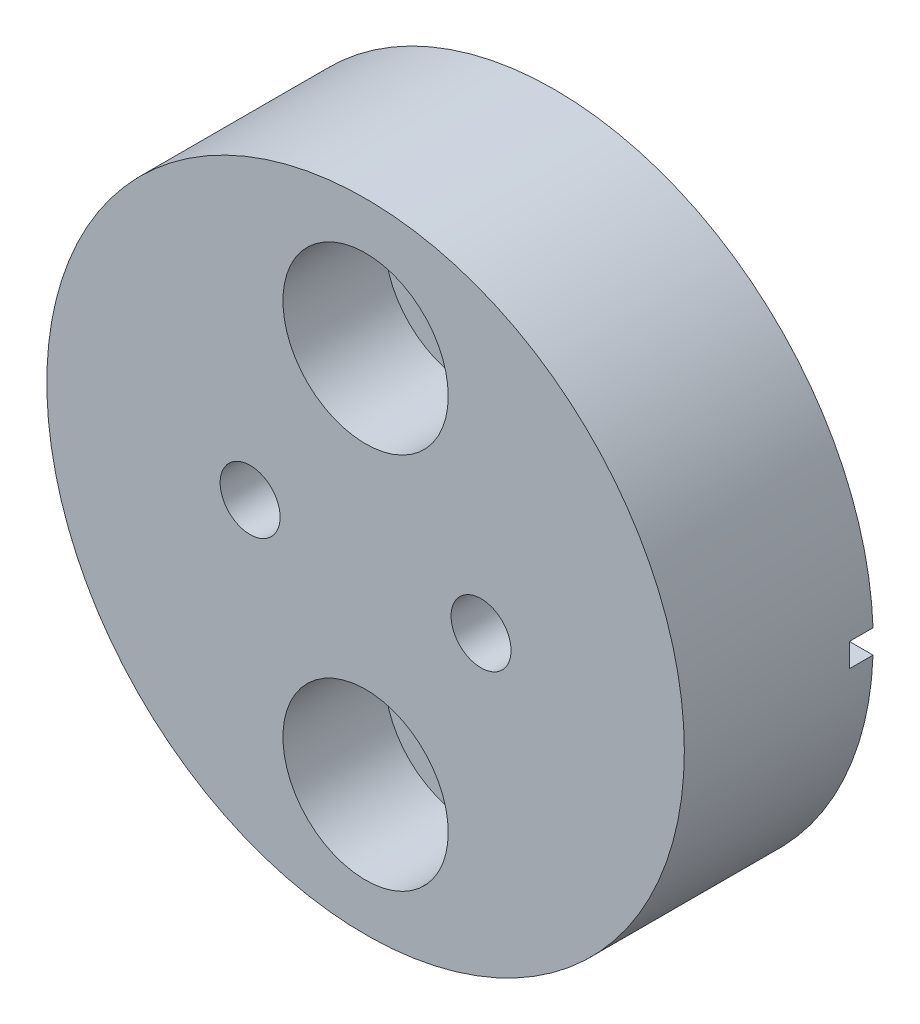
ISO-10303-21;
HEADER;
FILE_DESCRIPTION(('STEP AP214'),'2;1');
FILE_NAME('part.step','',(''),(''),'','','');
FILE_SCHEMA(('AUTOMOTIVE_DESIGN { 1 0 10303 214 1 1 1 1 }'));
ENDSEC;
DATA;
#1=APPLICATION_CONTEXT('core data for automotive mechanical design processes');
#2=APPLICATION_PROTOCOL_DEFINITION('international standard','automotive_design',2000,#1);
#3=PRODUCT_CONTEXT('',#1,'mechanical');
#4=PRODUCT('Part','Part','',(#3));
#5=PRODUCT_RELATED_PRODUCT_CATEGORY('part','',(#4));
#6=PRODUCT_DEFINITION_FORMATION('','',#4);
#7=PRODUCT_DEFINITION_CONTEXT('part definition',#1,'design');
#8=PRODUCT_DEFINITION('design','',#6,#7);
#9=PRODUCT_DEFINITION_SHAPE('','',#8);
#10=(LENGTH_UNIT() NAMED_UNIT(*) SI_UNIT(.MILLI.,.METRE.));
#11=(NAMED_UNIT(*) PLANE_ANGLE_UNIT() SI_UNIT($,.RADIAN.));
#12=(NAMED_UNIT(*) SI_UNIT($,.STERADIAN.) SOLID_ANGLE_UNIT());
#13=UNCERTAINTY_MEASURE_WITH_UNIT(LENGTH_MEASURE(1.E-05),#10,'distance_accuracy_value','');
#14=(GEOMETRIC_REPRESENTATION_CONTEXT(3) GLOBAL_UNCERTAINTY_ASSIGNED_CONTEXT((#13)) GLOBAL_UNIT_ASSIGNED_CONTEXT((#10,
#11,#12)) REPRESENTATION_CONTEXT('',''));
#15=CARTESIAN_POINT('',(0.,0.,0.));
#16=DIRECTION('',(0.,0.,1.));
#17=DIRECTION('',(1.,0.,0.));
#18=AXIS2_PLACEMENT_3D('',#15,#16,#17);
#19=CARTESIAN_POINT('',(0.,-8.,-2.));
#20=DIRECTION('',(0.,0.,1.));
#21=DIRECTION('',(1.,0.,0.));
#22=AXIS2_PLACEMENT_3D('',#19,#20,#21);
#23=CYLINDRICAL_SURFACE('',#22,2.3);
#24=CARTESIAN_POINT('',(0.,-8.,0.));
#25=DIRECTION('',(0.,0.,1.));
#26=DIRECTION('',(1.,0.,0.));
#27=AXIS2_PLACEMENT_3D('',#24,#25,#26);
#28=CIRCLE('',#27,2.3);
#29=CARTESIAN_POINT('',(2.3,-8.,0.));
#30=VERTEX_POINT('',#29);
#31=EDGE_CURVE('E158',#30,#30,#28,.F.);
#32=ORIENTED_EDGE('',*,*,#31,.T.);
#33=EDGE_LOOP('',(#32));
#34=FACE_BOUND('',#33,.T.);
#35=CARTESIAN_POINT('',(0.,-8.,3.68));
#36=DIRECTION('',(0.,0.,1.));
#37=DIRECTION('',(1.,0.,0.));
#38=AXIS2_PLACEMENT_3D('',#35,#36,#37);
#39=CIRCLE('',#38,2.3);
#40=CARTESIAN_POINT('',(2.3,-8.,3.68));
#41=VERTEX_POINT('',#40);
#42=EDGE_CURVE('E39',#41,#41,#39,.T.);
#43=ORIENTED_EDGE('',*,*,#42,.T.);
#44=EDGE_LOOP('',(#43));
#45=FACE_BOUND('',#44,.T.);
#46=ADVANCED_FACE('F35',(#34,#45),#23,.F.);
#47=CARTESIAN_POINT('',(0.,8.,-2.));
#48=DIRECTION('',(0.,0.,1.));
#49=DIRECTION('',(1.,0.,0.));
#50=AXIS2_PLACEMENT_3D('',#47,#48,#49);
#51=CYLINDRICAL_SURFACE('',#50,2.3);
#52=CARTESIAN_POINT('',(0.,8.,0.));
#53=DIRECTION('',(0.,0.,1.));
#54=DIRECTION('',(1.,0.,0.));
#55=AXIS2_PLACEMENT_3D('',#52,#53,#54);
#56=CIRCLE('',#55,2.3);
#57=CARTESIAN_POINT('',(2.3,8.,0.));
#58=VERTEX_POINT('',#57);
#59=EDGE_CURVE('E167',#58,#58,#56,.T.);
#60=ORIENTED_EDGE('',*,*,#59,.F.);
#61=EDGE_LOOP('',(#60));
#62=FACE_BOUND('',#61,.T.);
#63=CARTESIAN_POINT('',(0.,8.,3.68));
#64=DIRECTION('',(0.,0.,1.));
#65=DIRECTION('',(1.,0.,0.));
#66=AXIS2_PLACEMENT_3D('',#63,#64,#65);
#67=CIRCLE('',#66,2.3);
#68=CARTESIAN_POINT('',(2.3,8.,3.68));
#69=VERTEX_POINT('',#68);
#70=EDGE_CURVE('E131',#69,#69,#67,.F.);
#71=ORIENTED_EDGE('',*,*,#70,.F.);
#72=EDGE_LOOP('',(#71));
#73=FACE_BOUND('',#72,.T.);
#74=ADVANCED_FACE('F223',(#62,#73),#51,.F.);
#75=CARTESIAN_POINT('',(0.,0.,8.));
#76=DIRECTION('',(0.,0.,-1.));
#77=DIRECTION('',(-1.,0.,0.));
#78=AXIS2_PLACEMENT_3D('',#75,#76,#77);
#79=CYLINDRICAL_SURFACE('',#78,13.5);
#80=CARTESIAN_POINT('',(0.,0.,8.));
#81=DIRECTION('',(0.,0.,1.));
#82=DIRECTION('',(1.,0.,0.));
#83=AXIS2_PLACEMENT_3D('',#80,#81,#82);
#84=CIRCLE('',#83,13.5);
#85=CARTESIAN_POINT('',(13.5,0.,8.));
#86=VERTEX_POINT('',#85);
#87=EDGE_CURVE('E159',#86,#86,#84,.T.);
#88=ORIENTED_EDGE('',*,*,#87,.F.);
#89=EDGE_LOOP('',(#88));
#90=FACE_BOUND('',#89,.T.);
#91=DIRECTION('',(0.,0.,-1.));
#92=VECTOR('',#91,1.);
#93=CARTESIAN_POINT('',(-13.490737563232,0.5,8.));
#94=LINE('',#93,#92);
#95=CARTESIAN_POINT('',(-13.490737563232,0.5,1.));
#96=VERTEX_POINT('',#95);
#97=CARTESIAN_POINT('',(-13.490737563232,0.5,0.));
#98=VERTEX_POINT('',#97);
#99=EDGE_CURVE('E135',#96,#98,#94,.T.);
#100=ORIENTED_EDGE('',*,*,#99,.F.);
#101=CARTESIAN_POINT('',(0.,0.,1.));
#102=DIRECTION('',(0.,0.,-1.));
#103=DIRECTION('',(-1.,0.,0.));
#104=AXIS2_PLACEMENT_3D('',#101,#102,#103);
#105=CIRCLE('',#104,13.5);
#106=CARTESIAN_POINT('',(-13.490737563232,-0.5,1.));
#107=VERTEX_POINT('',#106);
#108=EDGE_CURVE('E11',#107,#96,#105,.T.);
#109=ORIENTED_EDGE('',*,*,#108,.F.);
#110=DIRECTION('',(0.,0.,-1.));
#111=VECTOR('',#110,1.);
#112=CARTESIAN_POINT('',(-13.490737563232,-0.5,8.));
#113=LINE('',#112,#111);
#114=CARTESIAN_POINT('',(-13.490737563232,-0.5,0.));
#115=VERTEX_POINT('',#114);
#116=EDGE_CURVE('E108',#115,#107,#113,.F.);
#117=ORIENTED_EDGE('',*,*,#116,.F.);
#118=CARTESIAN_POINT('',(0.,0.,0.));
#119=DIRECTION('',(0.,0.,1.));
#120=DIRECTION('',(1.,0.,0.));
#121=AXIS2_PLACEMENT_3D('',#118,#119,#120);
#122=CIRCLE('',#121,13.5);
#123=CARTESIAN_POINT('',(13.490737563232,-0.5,0.));
#124=VERTEX_POINT('',#123);
#125=EDGE_CURVE('E166',#115,#124,#122,.T.);
#126=ORIENTED_EDGE('',*,*,#125,.T.);
#127=DIRECTION('',(0.,0.,-1.));
#128=VECTOR('',#127,1.);
#129=CARTESIAN_POINT('',(13.490737563232,-0.5,8.));
#130=LINE('',#129,#128);
#131=CARTESIAN_POINT('',(13.490737563232,-0.5,1.));
#132=VERTEX_POINT('',#131);
#133=EDGE_CURVE('E155',#124,#132,#130,.F.);
#134=ORIENTED_EDGE('',*,*,#133,.T.);
#135=CARTESIAN_POINT('',(0.,0.,1.));
#136=DIRECTION('',(0.,0.,-1.));
#137=DIRECTION('',(-1.,0.,0.));
#138=AXIS2_PLACEMENT_3D('',#135,#136,#137);
#139=CIRCLE('',#138,13.5);
#140=CARTESIAN_POINT('',(13.490737563232,0.5,1.));
#141=VERTEX_POINT('',#140);
#142=EDGE_CURVE('E174',#141,#132,#139,.T.);
#143=ORIENTED_EDGE('',*,*,#142,.F.);
#144=DIRECTION('',(0.,0.,-1.));
#145=VECTOR('',#144,1.);
#146=CARTESIAN_POINT('',(13.490737563232,0.5,8.));
#147=LINE('',#146,#145);
#148=CARTESIAN_POINT('',(13.490737563232,0.5,0.));
#149=VERTEX_POINT('',#148);
#150=EDGE_CURVE('E151',#141,#149,#147,.T.);
#151=ORIENTED_EDGE('',*,*,#150,.T.);
#152=EDGE_CURVE('E163',#149,#98,#122,.T.);
#153=ORIENTED_EDGE('',*,*,#152,.T.);
#154=EDGE_LOOP('',(#100,#109,#117,#126,#134,#143,#151,#153));
#155=FACE_BOUND('',#154,.T.);
#156=ADVANCED_FACE('F37',(#90,#155),#79,.T.);
#157=CARTESIAN_POINT('',(0.,0.,0.));
#158=DIRECTION('',(0.,0.,1.));
#159=DIRECTION('',(1.,0.,0.));
#160=AXIS2_PLACEMENT_3D('',#157,#158,#159);
#161=PLANE('',#160);
#162=CARTESIAN_POINT('',(-4.89,0.,0.));
#163=DIRECTION('',(0.,0.,1.));
#164=DIRECTION('',(1.,0.,0.));
#165=AXIS2_PLACEMENT_3D('',#162,#163,#164);
#166=CIRCLE('',#165,1.27);
#167=CARTESIAN_POINT('',(-3.62,0.,0.));
#168=VERTEX_POINT('',#167);
#169=EDGE_CURVE('E197',#168,#168,#166,.T.);
#170=ORIENTED_EDGE('',*,*,#169,.T.);
#171=EDGE_LOOP('',(#170));
#172=FACE_BOUND('',#171,.T.);
#173=CARTESIAN_POINT('',(4.89,0.,0.));
#174=DIRECTION('',(0.,0.,1.));
#175=DIRECTION('',(1.,0.,0.));
#176=AXIS2_PLACEMENT_3D('',#173,#174,#175);
#177=CIRCLE('',#176,1.27);
#178=CARTESIAN_POINT('',(6.16,0.,0.));
#179=VERTEX_POINT('',#178);
#180=EDGE_CURVE('E189',#179,#179,#177,.T.);
#181=ORIENTED_EDGE('',*,*,#180,.T.);
#182=EDGE_LOOP('',(#181));
#183=FACE_BOUND('',#182,.T.);
#184=ORIENTED_EDGE('',*,*,#59,.T.);
#185=EDGE_LOOP('',(#184));
#186=FACE_BOUND('',#185,.T.);
#187=ORIENTED_EDGE('',*,*,#31,.F.);
#188=EDGE_LOOP('',(#187));
#189=FACE_BOUND('',#188,.T.);
#190=DIRECTION('',(-1.,0.,0.));
#191=VECTOR('',#190,1.);
#192=CARTESIAN_POINT('',(-18.5,0.5,0.));
#193=LINE('',#192,#191);
#194=CARTESIAN_POINT('',(-8.5,0.5,0.));
#195=VERTEX_POINT('',#194);
#196=EDGE_CURVE('E122',#195,#98,#193,.T.);
#197=ORIENTED_EDGE('',*,*,#196,.T.);
#198=ORIENTED_EDGE('',*,*,#152,.F.);
#199=DIRECTION('',(1.,0.,0.));
#200=VECTOR('',#199,1.);
#201=CARTESIAN_POINT('',(18.5,0.5,0.));
#202=LINE('',#201,#200);
#203=CARTESIAN_POINT('',(8.5,0.5,0.));
#204=VERTEX_POINT('',#203);
#205=EDGE_CURVE('E141',#204,#149,#202,.T.);
#206=ORIENTED_EDGE('',*,*,#205,.F.);
#207=DIRECTION('',(0.,1.,0.));
#208=VECTOR('',#207,1.);
#209=CARTESIAN_POINT('',(8.5,0.5,0.));
#210=LINE('',#209,#208);
#211=CARTESIAN_POINT('',(8.5,-0.5,0.));
#212=VERTEX_POINT('',#211);
#213=EDGE_CURVE('E60',#212,#204,#210,.T.);
#214=ORIENTED_EDGE('',*,*,#213,.F.);
#215=DIRECTION('',(1.,0.,0.));
#216=VECTOR('',#215,1.);
#217=CARTESIAN_POINT('',(0.,-0.5,0.));
#218=LINE('',#217,#216);
#219=EDGE_CURVE('E162',#212,#124,#218,.T.);
#220=ORIENTED_EDGE('',*,*,#219,.T.);
#221=ORIENTED_EDGE('',*,*,#125,.F.);
#222=DIRECTION('',(-1.,0.,0.));
#223=VECTOR('',#222,1.);
#224=CARTESIAN_POINT('',(0.,-0.5,0.));
#225=LINE('',#224,#223);
#226=CARTESIAN_POINT('',(-8.5,-0.5,0.));
#227=VERTEX_POINT('',#226);
#228=EDGE_CURVE('E44',#227,#115,#225,.T.);
#229=ORIENTED_EDGE('',*,*,#228,.F.);
#230=DIRECTION('',(0.,1.,0.));
#231=VECTOR('',#230,1.);
#232=CARTESIAN_POINT('',(-8.5,0.5,0.));
#233=LINE('',#232,#231);
#234=EDGE_CURVE('E52',#227,#195,#233,.T.);
#235=ORIENTED_EDGE('',*,*,#234,.T.);
#236=EDGE_LOOP('',(#197,#198,#206,#214,#220,#221,#229,#235));
#237=FACE_BOUND('',#236,.T.);
#238=ADVANCED_FACE('F211',(#172,#183,#186,#189,#237),#161,.F.);
#239=CARTESIAN_POINT('',(0.,0.,8.));
#240=DIRECTION('',(0.,0.,1.));
#241=DIRECTION('',(1.,0.,0.));
#242=AXIS2_PLACEMENT_3D('',#239,#240,#241);
#243=PLANE('',#242);
#244=CARTESIAN_POINT('',(-4.89,0.,8.));
#245=DIRECTION('',(0.,0.,1.));
#246=DIRECTION('',(1.,0.,0.));
#247=AXIS2_PLACEMENT_3D('',#244,#245,#246);
#248=CIRCLE('',#247,1.27);
#249=CARTESIAN_POINT('',(-3.62,0.,8.));
#250=VERTEX_POINT('',#249);
#251=EDGE_CURVE('E200',#250,#250,#248,.T.);
#252=ORIENTED_EDGE('',*,*,#251,.F.);
#253=EDGE_LOOP('',(#252));
#254=FACE_BOUND('',#253,.T.);
#255=CARTESIAN_POINT('',(4.89,0.,8.));
#256=DIRECTION('',(0.,0.,1.));
#257=DIRECTION('',(1.,0.,0.));
#258=AXIS2_PLACEMENT_3D('',#255,#256,#257);
#259=CIRCLE('',#258,1.27);
#260=CARTESIAN_POINT('',(6.16,0.,8.));
#261=VERTEX_POINT('',#260);
#262=EDGE_CURVE('E194',#261,#261,#259,.T.);
#263=ORIENTED_EDGE('',*,*,#262,.F.);
#264=EDGE_LOOP('',(#263));
#265=FACE_BOUND('',#264,.T.);
#266=CARTESIAN_POINT('',(0.,-8.,8.));
#267=DIRECTION('',(0.,0.,-1.));
#268=DIRECTION('',(1.,0.,0.));
#269=AXIS2_PLACEMENT_3D('',#266,#267,#268);
#270=CIRCLE('',#269,3.5);
#271=CARTESIAN_POINT('',(3.5,-8.,8.));
#272=VERTEX_POINT('',#271);
#273=EDGE_CURVE('E185',#272,#272,#270,.T.);
#274=ORIENTED_EDGE('',*,*,#273,.T.);
#275=EDGE_LOOP('',(#274));
#276=FACE_BOUND('',#275,.T.);
#277=CARTESIAN_POINT('',(0.,8.,8.));
#278=DIRECTION('',(0.,0.,1.));
#279=DIRECTION('',(1.,0.,0.));
#280=AXIS2_PLACEMENT_3D('',#277,#278,#279);
#281=CIRCLE('',#280,3.5);
#282=CARTESIAN_POINT('',(3.5,8.,8.));
#283=VERTEX_POINT('',#282);
#284=EDGE_CURVE('E127',#283,#283,#281,.T.);
#285=ORIENTED_EDGE('',*,*,#284,.F.);
#286=EDGE_LOOP('',(#285));
#287=FACE_BOUND('',#286,.T.);
#288=ORIENTED_EDGE('',*,*,#87,.T.);
#289=EDGE_LOOP('',(#288));
#290=FACE_BOUND('',#289,.T.);
#291=ADVANCED_FACE('F207',(#254,#265,#276,#287,#290),#243,.T.);
#292=CARTESIAN_POINT('',(0.,0.,1.));
#293=DIRECTION('',(0.,0.,-1.));
#294=DIRECTION('',(-1.,0.,0.));
#295=AXIS2_PLACEMENT_3D('',#292,#293,#294);
#296=PLANE('',#295);
#297=ORIENTED_EDGE('',*,*,#142,.T.);
#298=DIRECTION('',(-1.,0.,0.));
#299=VECTOR('',#298,1.);
#300=CARTESIAN_POINT('',(18.5,-0.5,1.));
#301=LINE('',#300,#299);
#302=CARTESIAN_POINT('',(8.5,-0.5,1.));
#303=VERTEX_POINT('',#302);
#304=EDGE_CURVE('E144',#132,#303,#301,.T.);
#305=ORIENTED_EDGE('',*,*,#304,.T.);
#306=DIRECTION('',(0.,1.,0.));
#307=VECTOR('',#306,1.);
#308=CARTESIAN_POINT('',(8.5,0.5,1.));
#309=LINE('',#308,#307);
#310=CARTESIAN_POINT('',(8.5,0.5,1.));
#311=VERTEX_POINT('',#310);
#312=EDGE_CURVE('E137',#303,#311,#309,.T.);
#313=ORIENTED_EDGE('',*,*,#312,.T.);
#314=DIRECTION('',(1.,0.,0.));
#315=VECTOR('',#314,1.);
#316=CARTESIAN_POINT('',(18.5,0.5,1.));
#317=LINE('',#316,#315);
#318=EDGE_CURVE('E140',#311,#141,#317,.T.);
#319=ORIENTED_EDGE('',*,*,#318,.T.);
#320=EDGE_LOOP('',(#297,#305,#313,#319));
#321=FACE_BOUND('',#320,.T.);
#322=ADVANCED_FACE('F210',(#321),#296,.T.);
#323=CARTESIAN_POINT('',(18.5,-0.5,1.));
#324=DIRECTION('',(0.,-1.,0.));
#325=DIRECTION('',(0.,0.,-1.));
#326=AXIS2_PLACEMENT_3D('',#323,#324,#325);
#327=PLANE('',#326);
#328=ORIENTED_EDGE('',*,*,#219,.F.);
#329=DIRECTION('',(0.,0.,-1.));
#330=VECTOR('',#329,1.);
#331=CARTESIAN_POINT('',(8.5,-0.5,1.));
#332=LINE('',#331,#330);
#333=EDGE_CURVE('E149',#303,#212,#332,.T.);
#334=ORIENTED_EDGE('',*,*,#333,.F.);
#335=ORIENTED_EDGE('',*,*,#304,.F.);
#336=ORIENTED_EDGE('',*,*,#133,.F.);
#337=EDGE_LOOP('',(#328,#334,#335,#336));
#338=FACE_BOUND('',#337,.T.);
#339=ADVANCED_FACE('F235',(#338),#327,.F.);
#340=CARTESIAN_POINT('',(18.5,0.5,1.));
#341=DIRECTION('',(0.,1.,0.));
#342=DIRECTION('',(0.,0.,1.));
#343=AXIS2_PLACEMENT_3D('',#340,#341,#342);
#344=PLANE('',#343);
#345=ORIENTED_EDGE('',*,*,#318,.F.);
#346=DIRECTION('',(0.,0.,-1.));
#347=VECTOR('',#346,1.);
#348=CARTESIAN_POINT('',(8.5,0.5,1.));
#349=LINE('',#348,#347);
#350=EDGE_CURVE('E146',#311,#204,#349,.T.);
#351=ORIENTED_EDGE('',*,*,#350,.T.);
#352=ORIENTED_EDGE('',*,*,#205,.T.);
#353=ORIENTED_EDGE('',*,*,#150,.F.);
#354=EDGE_LOOP('',(#345,#351,#352,#353));
#355=FACE_BOUND('',#354,.T.);
#356=ADVANCED_FACE('F239',(#355),#344,.F.);
#357=CARTESIAN_POINT('',(8.5,0.5,1.));
#358=DIRECTION('',(-1.,0.,0.));
#359=DIRECTION('',(0.,0.,1.));
#360=AXIS2_PLACEMENT_3D('',#357,#358,#359);
#361=PLANE('',#360);
#362=ORIENTED_EDGE('',*,*,#213,.T.);
#363=ORIENTED_EDGE('',*,*,#350,.F.);
#364=ORIENTED_EDGE('',*,*,#312,.F.);
#365=ORIENTED_EDGE('',*,*,#333,.T.);
#366=EDGE_LOOP('',(#362,#363,#364,#365));
#367=FACE_BOUND('',#366,.T.);
#368=ADVANCED_FACE('F242',(#367),#361,.F.);
#369=CARTESIAN_POINT('',(0.,0.,1.));
#370=DIRECTION('',(0.,0.,-1.));
#371=DIRECTION('',(1.,0.,0.));
#372=AXIS2_PLACEMENT_3D('',#369,#370,#371);
#373=PLANE('',#372);
#374=ORIENTED_EDGE('',*,*,#108,.T.);
#375=DIRECTION('',(-1.,0.,0.));
#376=VECTOR('',#375,1.);
#377=CARTESIAN_POINT('',(-18.5,0.5,1.));
#378=LINE('',#377,#376);
#379=CARTESIAN_POINT('',(-8.5,0.5,1.));
#380=VERTEX_POINT('',#379);
#381=EDGE_CURVE('E112',#380,#96,#378,.T.);
#382=ORIENTED_EDGE('',*,*,#381,.F.);
#383=DIRECTION('',(0.,1.,0.));
#384=VECTOR('',#383,1.);
#385=CARTESIAN_POINT('',(-8.5,0.5,1.));
#386=LINE('',#385,#384);
#387=CARTESIAN_POINT('',(-8.5,-0.5,1.));
#388=VERTEX_POINT('',#387);
#389=EDGE_CURVE('E113',#388,#380,#386,.T.);
#390=ORIENTED_EDGE('',*,*,#389,.F.);
#391=DIRECTION('',(1.,0.,0.));
#392=VECTOR('',#391,1.);
#393=CARTESIAN_POINT('',(-18.5,-0.5,1.));
#394=LINE('',#393,#392);
#395=EDGE_CURVE('E103',#107,#388,#394,.T.);
#396=ORIENTED_EDGE('',*,*,#395,.F.);
#397=EDGE_LOOP('',(#374,#382,#390,#396));
#398=FACE_BOUND('',#397,.T.);
#399=ADVANCED_FACE('F120',(#398),#373,.T.);
#400=CARTESIAN_POINT('',(-18.5,0.5,1.));
#401=DIRECTION('',(0.,-1.,0.));
#402=DIRECTION('',(0.,0.,-1.));
#403=AXIS2_PLACEMENT_3D('',#400,#401,#402);
#404=PLANE('',#403);
#405=ORIENTED_EDGE('',*,*,#99,.T.);
#406=ORIENTED_EDGE('',*,*,#196,.F.);
#407=DIRECTION('',(0.,0.,-1.));
#408=VECTOR('',#407,1.);
#409=CARTESIAN_POINT('',(-8.5,0.5,1.));
#410=LINE('',#409,#408);
#411=EDGE_CURVE('E118',#380,#195,#410,.T.);
#412=ORIENTED_EDGE('',*,*,#411,.F.);
#413=ORIENTED_EDGE('',*,*,#381,.T.);
#414=EDGE_LOOP('',(#405,#406,#412,#413));
#415=FACE_BOUND('',#414,.T.);
#416=ADVANCED_FACE('F227',(#415),#404,.T.);
#417=CARTESIAN_POINT('',(-18.5,-0.5,1.));
#418=DIRECTION('',(0.,1.,0.));
#419=DIRECTION('',(0.,0.,1.));
#420=AXIS2_PLACEMENT_3D('',#417,#418,#419);
#421=PLANE('',#420);
#422=ORIENTED_EDGE('',*,*,#116,.T.);
#423=ORIENTED_EDGE('',*,*,#395,.T.);
#424=DIRECTION('',(0.,0.,-1.));
#425=VECTOR('',#424,1.);
#426=CARTESIAN_POINT('',(-8.5,-0.5,1.));
#427=LINE('',#426,#425);
#428=EDGE_CURVE('E105',#388,#227,#427,.T.);
#429=ORIENTED_EDGE('',*,*,#428,.T.);
#430=ORIENTED_EDGE('',*,*,#228,.T.);
#431=EDGE_LOOP('',(#422,#423,#429,#430));
#432=FACE_BOUND('',#431,.T.);
#433=ADVANCED_FACE('F104',(#432),#421,.T.);
#434=CARTESIAN_POINT('',(-8.5,0.5,1.));
#435=DIRECTION('',(-1.,0.,0.));
#436=DIRECTION('',(0.,0.,1.));
#437=AXIS2_PLACEMENT_3D('',#434,#435,#436);
#438=PLANE('',#437);
#439=ORIENTED_EDGE('',*,*,#234,.F.);
#440=ORIENTED_EDGE('',*,*,#428,.F.);
#441=ORIENTED_EDGE('',*,*,#389,.T.);
#442=ORIENTED_EDGE('',*,*,#411,.T.);
#443=EDGE_LOOP('',(#439,#440,#441,#442));
#444=FACE_BOUND('',#443,.T.);
#445=ADVANCED_FACE('F116',(#444),#438,.T.);
#446=CARTESIAN_POINT('',(0.,8.,3.68));
#447=DIRECTION('',(0.,0.,1.));
#448=DIRECTION('',(1.,0.,0.));
#449=AXIS2_PLACEMENT_3D('',#446,#447,#448);
#450=PLANE('',#449);
#451=CARTESIAN_POINT('',(0.,8.,3.68));
#452=DIRECTION('',(0.,0.,1.));
#453=DIRECTION('',(1.,0.,0.));
#454=AXIS2_PLACEMENT_3D('',#451,#452,#453);
#455=CIRCLE('',#454,3.5);
#456=CARTESIAN_POINT('',(3.5,8.,3.68));
#457=VERTEX_POINT('',#456);
#458=EDGE_CURVE('E177',#457,#457,#455,.T.);
#459=ORIENTED_EDGE('',*,*,#458,.T.);
#460=EDGE_LOOP('',(#459));
#461=FACE_BOUND('',#460,.T.);
#462=ORIENTED_EDGE('',*,*,#70,.T.);
#463=EDGE_LOOP('',(#462));
#464=FACE_BOUND('',#463,.T.);
#465=ADVANCED_FACE('F291',(#461,#464),#450,.T.);
#466=CARTESIAN_POINT('',(0.,8.,3.68));
#467=DIRECTION('',(0.,0.,1.));
#468=DIRECTION('',(1.,0.,0.));
#469=AXIS2_PLACEMENT_3D('',#466,#467,#468);
#470=CYLINDRICAL_SURFACE('',#469,3.5);
#471=ORIENTED_EDGE('',*,*,#458,.F.);
#472=EDGE_LOOP('',(#471));
#473=FACE_BOUND('',#472,.T.);
#474=ORIENTED_EDGE('',*,*,#284,.T.);
#475=EDGE_LOOP('',(#474));
#476=FACE_BOUND('',#475,.T.);
#477=ADVANCED_FACE('F289',(#473,#476),#470,.F.);
#478=CARTESIAN_POINT('',(0.,-8.,3.68));
#479=DIRECTION('',(0.,0.,1.));
#480=DIRECTION('',(1.,0.,0.));
#481=AXIS2_PLACEMENT_3D('',#478,#479,#480);
#482=CYLINDRICAL_SURFACE('',#481,3.5);
#483=CARTESIAN_POINT('',(0.,-8.,3.68));
#484=DIRECTION('',(0.,0.,-1.));
#485=DIRECTION('',(1.,0.,0.));
#486=AXIS2_PLACEMENT_3D('',#483,#484,#485);
#487=CIRCLE('',#486,3.5);
#488=CARTESIAN_POINT('',(3.5,-8.,3.68));
#489=VERTEX_POINT('',#488);
#490=EDGE_CURVE('E188',#489,#489,#487,.T.);
#491=ORIENTED_EDGE('',*,*,#490,.T.);
#492=EDGE_LOOP('',(#491));
#493=FACE_BOUND('',#492,.T.);
#494=ORIENTED_EDGE('',*,*,#273,.F.);
#495=EDGE_LOOP('',(#494));
#496=FACE_BOUND('',#495,.T.);
#497=ADVANCED_FACE('F283',(#493,#496),#482,.F.);
#498=CARTESIAN_POINT('',(0.,-8.,3.68));
#499=DIRECTION('',(0.,0.,1.));
#500=DIRECTION('',(1.,0.,0.));
#501=AXIS2_PLACEMENT_3D('',#498,#499,#500);
#502=PLANE('',#501);
#503=ORIENTED_EDGE('',*,*,#42,.F.);
#504=EDGE_LOOP('',(#503));
#505=FACE_BOUND('',#504,.T.);
#506=ORIENTED_EDGE('',*,*,#490,.F.);
#507=EDGE_LOOP('',(#506));
#508=FACE_BOUND('',#507,.T.);
#509=ADVANCED_FACE('F275',(#505,#508),#502,.T.);
#510=CARTESIAN_POINT('',(4.89,0.,-24.5));
#511=DIRECTION('',(0.,0.,1.));
#512=DIRECTION('',(1.,0.,0.));
#513=AXIS2_PLACEMENT_3D('',#510,#511,#512);
#514=CYLINDRICAL_SURFACE('',#513,1.27);
#515=ORIENTED_EDGE('',*,*,#262,.T.);
#516=EDGE_LOOP('',(#515));
#517=FACE_BOUND('',#516,.T.);
#518=ORIENTED_EDGE('',*,*,#180,.F.);
#519=EDGE_LOOP('',(#518));
#520=FACE_BOUND('',#519,.T.);
#521=ADVANCED_FACE('F273',(#517,#520),#514,.F.);
#522=CARTESIAN_POINT('',(-4.89,0.,-24.5));
#523=DIRECTION('',(0.,0.,1.));
#524=DIRECTION('',(1.,0.,0.));
#525=AXIS2_PLACEMENT_3D('',#522,#523,#524);
#526=CYLINDRICAL_SURFACE('',#525,1.27);
#527=ORIENTED_EDGE('',*,*,#251,.T.);
#528=EDGE_LOOP('',(#527));
#529=FACE_BOUND('',#528,.T.);
#530=ORIENTED_EDGE('',*,*,#169,.F.);
#531=EDGE_LOOP('',(#530));
#532=FACE_BOUND('',#531,.T.);
#533=ADVANCED_FACE('F204',(#529,#532),#526,.F.);
#534=CLOSED_SHELL('',(#46,#74,#156,#238,#291,#322,#339,#356,#368,#399,#416,#433,#445,#465,#477,
#497,#509,#521,#533));
#535=MANIFOLD_SOLID_BREP('B2',#534);
#536=ADVANCED_BREP_SHAPE_REPRESENTATION('',(#18,#535),#14);
#537=SHAPE_DEFINITION_REPRESENTATION(#9,#536);
ENDSEC;
END-ISO-10303-21;
